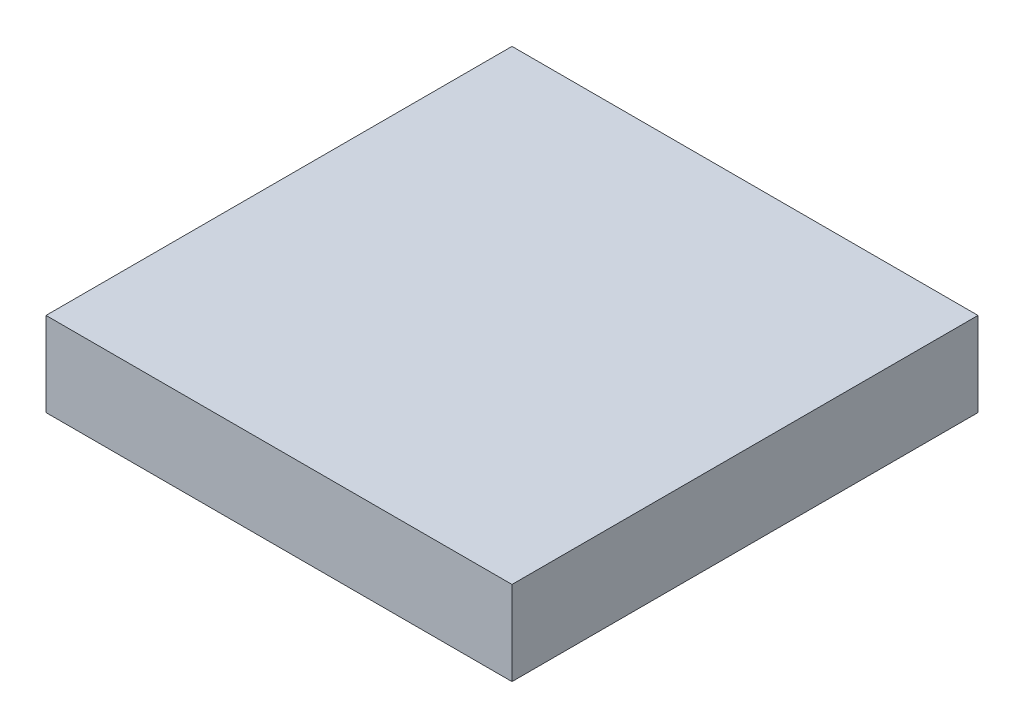
ISO-10303-21;
HEADER;
FILE_DESCRIPTION(('STEP AP214'),'2;1');
FILE_NAME('part.step','',(''),(''),'','','');
FILE_SCHEMA(('AUTOMOTIVE_DESIGN { 1 0 10303 214 1 1 1 1 }'));
ENDSEC;
DATA;
#1=APPLICATION_CONTEXT('core data for automotive mechanical design processes');
#2=APPLICATION_PROTOCOL_DEFINITION('international standard','automotive_design',2000,#1);
#3=PRODUCT_CONTEXT('',#1,'mechanical');
#4=PRODUCT('Part','Part','',(#3));
#5=PRODUCT_RELATED_PRODUCT_CATEGORY('part','',(#4));
#6=PRODUCT_DEFINITION_FORMATION('','',#4);
#7=PRODUCT_DEFINITION_CONTEXT('part definition',#1,'design');
#8=PRODUCT_DEFINITION('design','',#6,#7);
#9=PRODUCT_DEFINITION_SHAPE('','',#8);
#10=(LENGTH_UNIT() NAMED_UNIT(*) SI_UNIT(.MILLI.,.METRE.));
#11=(NAMED_UNIT(*) PLANE_ANGLE_UNIT() SI_UNIT($,.RADIAN.));
#12=(NAMED_UNIT(*) SI_UNIT($,.STERADIAN.) SOLID_ANGLE_UNIT());
#13=UNCERTAINTY_MEASURE_WITH_UNIT(LENGTH_MEASURE(1.E-05),#10,'distance_accuracy_value','');
#14=(GEOMETRIC_REPRESENTATION_CONTEXT(3) GLOBAL_UNCERTAINTY_ASSIGNED_CONTEXT((#13)) GLOBAL_UNIT_ASSIGNED_CONTEXT((#10,
#11,#12)) REPRESENTATION_CONTEXT('',''));
#15=CARTESIAN_POINT('',(0.,0.,0.));
#16=DIRECTION('',(0.,0.,1.));
#17=DIRECTION('',(1.,0.,0.));
#18=AXIS2_PLACEMENT_3D('',#15,#16,#17);
#19=CARTESIAN_POINT('',(-19.9596626410732,3.1481690140845,32.));
#20=DIRECTION('',(-0.42156835373353,0.906796627216049,0.));
#21=DIRECTION('',(-0.906796627216048,-0.42156835373353,0.));
#22=AXIS2_PLACEMENT_3D('',#19,#20,#21);
#23=PLANE('',#22);
#24=CARTESIAN_POINT('',(-20.2959038003605,2.99185101760784,16.));
#25=DIRECTION('',(0.42156835373353,-0.906796627216048,0.));
#26=DIRECTION('',(0.906796627216048,0.42156835373353,0.));
#27=AXIS2_PLACEMENT_3D('',#24,#25,#26);
#28=CIRCLE('',#27,11.6034843030688);
#29=CARTESIAN_POINT('',(-27.3625184552216,-0.293407238882376,7.40285626489718));
#30=VERTEX_POINT('',#29);
#31=CARTESIAN_POINT('',(-20.2959038003605,2.99185101760784,4.39651569693117));
#32=VERTEX_POINT('',#31);
#33=EDGE_CURVE('E268',#30,#32,#28,.T.);
#34=ORIENTED_EDGE('',*,*,#33,.F.);
#35=DIRECTION('',(-0.671741727957964,-0.312291693517609,0.671741727957964));
#36=VECTOR('',#35,1.);
#37=CARTESIAN_POINT('',(-34.3992450116317,-3.56477056448951,14.4395823705585));
#38=LINE('',#37,#36);
#39=CARTESIAN_POINT('',(-19.9596626410732,3.1481690140845,0.));
#40=VERTEX_POINT('',#39);
#41=EDGE_CURVE('E192',#40,#30,#38,.T.);
#42=ORIENTED_EDGE('',*,*,#41,.F.);
#43=DIRECTION('',(0.,0.,-1.));
#44=VECTOR('',#43,1.);
#45=CARTESIAN_POINT('',(-19.9596626410732,3.1481690140845,32.));
#46=LINE('',#45,#44);
#47=CARTESIAN_POINT('',(-19.9596626410732,3.1481690140845,32.));
#48=VERTEX_POINT('',#47);
#49=EDGE_CURVE('E353',#48,#40,#46,.T.);
#50=ORIENTED_EDGE('',*,*,#49,.F.);
#51=DIRECTION('',(0.671741727957964,0.312291693517609,0.671741727957964));
#52=VECTOR('',#51,1.);
#53=CARTESIAN_POINT('',(-19.9596626410732,3.1481690140845,32.));
#54=LINE('',#53,#52);
#55=CARTESIAN_POINT('',(-27.3623867182494,-0.293345994567157,24.5972757705994));
#56=VERTEX_POINT('',#55);
#57=EDGE_CURVE('E213',#56,#48,#54,.T.);
#58=ORIENTED_EDGE('',*,*,#57,.F.);
#59=CARTESIAN_POINT('',(-20.2959038003605,2.99185101760784,27.6034843030688));
#60=VERTEX_POINT('',#59);
#61=EDGE_CURVE('E158',#60,#56,#28,.T.);
#62=ORIENTED_EDGE('',*,*,#61,.F.);
#63=DIRECTION('',(0.,0.,1.));
#64=VECTOR('',#63,1.);
#65=CARTESIAN_POINT('',(-20.2959038003605,2.99185101760784,0.));
#66=LINE('',#65,#64);
#67=EDGE_CURVE('E162',#32,#60,#66,.T.);
#68=ORIENTED_EDGE('',*,*,#67,.F.);
#69=EDGE_LOOP('',(#34,#42,#50,#58,#62,#68));
#70=FACE_BOUND('',#69,.T.);
#71=ADVANCED_FACE('F35',(#70),#23,.F.);
#72=EDGE_CURVE('E274',#56,#30,#28,.T.);
#73=ORIENTED_EDGE('',*,*,#72,.F.);
#74=CARTESIAN_POINT('',(-35.9596626410732,-4.29020631428936,16.));
#75=VERTEX_POINT('',#74);
#76=EDGE_CURVE('E215',#75,#56,#54,.T.);
#77=ORIENTED_EDGE('',*,*,#76,.F.);
#78=EDGE_CURVE('E210',#30,#75,#38,.T.);
#79=ORIENTED_EDGE('',*,*,#78,.F.);
#80=EDGE_LOOP('',(#73,#77,#79));
#81=FACE_BOUND('',#80,.T.);
#82=ADVANCED_FACE('F259',(#81),#23,.F.);
#83=CARTESIAN_POINT('',(-52.9596626410732,2.58867680453672,1.20347185474998));
#84=DIRECTION('',(0.,-0.906796627216048,-0.42156835373353));
#85=DIRECTION('',(0.,0.42156835373353,-0.906796627216049));
#86=AXIS2_PLACEMENT_3D('',#83,#84,#85);
#87=PLANE('',#86);
#88=DIRECTION('',(1.,0.,0.));
#89=VECTOR('',#88,1.);
#90=CARTESIAN_POINT('',(0.,2.99431103187024,0.330949650528911));
#91=LINE('',#90,#89);
#92=CARTESIAN_POINT('',(-47.5670668167245,2.99431103187024,0.330949650528911));
#93=VERTEX_POINT('',#92);
#94=CARTESIAN_POINT('',(-24.3522584654219,2.99431103187024,0.330949650528911));
#95=VERTEX_POINT('',#94);
#96=EDGE_CURVE('E53',#93,#95,#91,.T.);
#97=ORIENTED_EDGE('',*,*,#96,.F.);
#98=CARTESIAN_POINT('',(-35.9596626410732,2.99431103187024,0.330949650528909));
#99=DIRECTION('',(0.,-0.906796627216048,-0.421568353733531));
#100=DIRECTION('',(0.,0.421568353733531,-0.906796627216048));
#101=AXIS2_PLACEMENT_3D('',#98,#99,#100);
#102=CIRCLE('',#101,11.6074041756513);
#103=CARTESIAN_POINT('',(-44.5586613166072,-0.29254507336374,7.40100128978124));
#104=VERTEX_POINT('',#103);
#105=EDGE_CURVE('E165',#104,#93,#102,.T.);
#106=ORIENTED_EDGE('',*,*,#105,.F.);
#107=DIRECTION('',(-0.671741727957964,0.312291693517609,-0.671741727957964));
#108=VECTOR('',#107,1.);
#109=CARTESIAN_POINT('',(-28.739871455794,-7.64667610357636,23.2197911852792));
#110=LINE('',#109,#108);
#111=CARTESIAN_POINT('',(-51.9596626410732,3.1481690140845,0.));
#112=VERTEX_POINT('',#111);
#113=EDGE_CURVE('E188',#104,#112,#110,.T.);
#114=ORIENTED_EDGE('',*,*,#113,.T.);
#115=DIRECTION('',(-1.,0.,0.));
#116=VECTOR('',#115,1.);
#117=CARTESIAN_POINT('',(0.,3.1481690140845,0.));
#118=LINE('',#117,#116);
#119=EDGE_CURVE('E282',#40,#112,#118,.T.);
#120=ORIENTED_EDGE('',*,*,#119,.F.);
#121=ORIENTED_EDGE('',*,*,#41,.T.);
#122=EDGE_CURVE('E39',#95,#30,#102,.T.);
#123=ORIENTED_EDGE('',*,*,#122,.F.);
#124=EDGE_LOOP('',(#97,#106,#114,#120,#121,#123));
#125=FACE_BOUND('',#124,.T.);
#126=ADVANCED_FACE('F264',(#125),#87,.T.);
#127=EDGE_CURVE('E191',#75,#104,#110,.T.);
#128=ORIENTED_EDGE('',*,*,#127,.T.);
#129=EDGE_CURVE('E184',#30,#104,#102,.T.);
#130=ORIENTED_EDGE('',*,*,#129,.F.);
#131=ORIENTED_EDGE('',*,*,#78,.T.);
#132=EDGE_LOOP('',(#128,#130,#131));
#133=FACE_BOUND('',#132,.T.);
#134=ADVANCED_FACE('F242',(#133),#87,.T.);
#135=CARTESIAN_POINT('',(-35.9596626410732,-4.29020631428936,32.));
#136=DIRECTION('',(0.42156835373353,0.906796627216049,0.));
#137=DIRECTION('',(-0.906796627216049,0.42156835373353,0.));
#138=AXIS2_PLACEMENT_3D('',#135,#136,#137);
#139=PLANE('',#138);
#140=CARTESIAN_POINT('',(-51.6301810914794,2.99499354973117,16.));
#141=DIRECTION('',(-0.42156835373353,-0.906796627216049,0.));
#142=DIRECTION('',(0.906796627216049,-0.42156835373353,0.));
#143=AXIS2_PLACEMENT_3D('',#140,#141,#142);
#144=CIRCLE('',#143,11.6084917234314);
#145=CARTESIAN_POINT('',(-44.559064155417,-0.292357810347127,24.5994015143438));
#146=VERTEX_POINT('',#145);
#147=EDGE_CURVE('E185',#104,#146,#144,.T.);
#148=ORIENTED_EDGE('',*,*,#147,.F.);
#149=ORIENTED_EDGE('',*,*,#127,.F.);
#150=CARTESIAN_POINT('',(-44.559064155417,-0.292357810347124,24.5994015143438));
#151=DIRECTION('',(0.671741727957965,-0.312291693517609,-0.671741727957964));
#152=VECTOR('',#151,1.);
#153=LINE('',#150,#152);
#154=EDGE_CURVE('E225',#146,#75,#153,.T.);
#155=ORIENTED_EDGE('',*,*,#154,.F.);
#156=EDGE_LOOP('',(#148,#149,#155));
#157=FACE_BOUND('',#156,.T.);
#158=ADVANCED_FACE('F232',(#157),#139,.F.);
#159=CARTESIAN_POINT('',(-51.6301810914794,2.99499354973117,4.39150827656862));
#160=VERTEX_POINT('',#159);
#161=EDGE_CURVE('E193',#160,#104,#144,.T.);
#162=ORIENTED_EDGE('',*,*,#161,.F.);
#163=DIRECTION('',(0.,0.,-1.));
#164=VECTOR('',#163,1.);
#165=CARTESIAN_POINT('',(-51.6301810914794,2.99499354973117,16.));
#166=LINE('',#165,#164);
#167=CARTESIAN_POINT('',(-51.6301810914794,2.99499354973118,27.6084917234314));
#168=VERTEX_POINT('',#167);
#169=EDGE_CURVE('E61',#168,#160,#166,.T.);
#170=ORIENTED_EDGE('',*,*,#169,.F.);
#171=EDGE_CURVE('E310',#146,#168,#144,.T.);
#172=ORIENTED_EDGE('',*,*,#171,.F.);
#173=DIRECTION('',(0.671741727957964,-0.312291693517609,-0.671741727957964));
#174=VECTOR('',#173,1.);
#175=CARTESIAN_POINT('',(-43.1794538263524,-0.933736525002352,23.2197911852792));
#176=LINE('',#175,#174);
#177=CARTESIAN_POINT('',(-51.9596626410732,3.1481690140845,32.));
#178=VERTEX_POINT('',#177);
#179=EDGE_CURVE('E212',#178,#146,#176,.T.);
#180=ORIENTED_EDGE('',*,*,#179,.F.);
#181=DIRECTION('',(0.,0.,-1.));
#182=VECTOR('',#181,1.);
#183=CARTESIAN_POINT('',(-51.9596626410732,3.1481690140845,32.));
#184=LINE('',#183,#182);
#185=EDGE_CURVE('E291',#178,#112,#184,.T.);
#186=ORIENTED_EDGE('',*,*,#185,.T.);
#187=ORIENTED_EDGE('',*,*,#113,.F.);
#188=EDGE_LOOP('',(#162,#170,#172,#180,#186,#187));
#189=FACE_BOUND('',#188,.T.);
#190=ADVANCED_FACE('F241',(#189),#139,.F.);
#191=CARTESIAN_POINT('',(-52.9596626410732,-9.64417955727407,4.48356420507719));
#192=DIRECTION('',(0.,-0.906796627216048,0.42156835373353));
#193=DIRECTION('',(0.,-0.42156835373353,-0.906796627216049));
#194=AXIS2_PLACEMENT_3D('',#191,#192,#193);
#195=PLANE('',#194);
#196=CARTESIAN_POINT('',(-35.9596626410732,2.99510070606784,31.6707489444739));
#197=DIRECTION('',(0.,-0.906796627216048,0.42156835373353));
#198=DIRECTION('',(0.,-0.42156835373353,-0.906796627216048));
#199=AXIS2_PLACEMENT_3D('',#196,#197,#198);
#200=CIRCLE('',#199,11.6086624700781);
#201=CARTESIAN_POINT('',(-47.5683251111513,2.99510070606784,31.6707489444739));
#202=VERTEX_POINT('',#201);
#203=EDGE_CURVE('E295',#202,#146,#200,.T.);
#204=ORIENTED_EDGE('',*,*,#203,.F.);
#205=DIRECTION('',(-1.,0.,0.));
#206=VECTOR('',#205,1.);
#207=CARTESIAN_POINT('',(-47.5683251111513,2.99510070606784,31.6707489444739));
#208=LINE('',#207,#206);
#209=CARTESIAN_POINT('',(-24.3510001709951,2.99510070606784,31.6707489444739));
#210=VERTEX_POINT('',#209);
#211=EDGE_CURVE('E298',#210,#202,#208,.T.);
#212=ORIENTED_EDGE('',*,*,#211,.F.);
#213=EDGE_CURVE('E45',#56,#210,#200,.T.);
#214=ORIENTED_EDGE('',*,*,#213,.F.);
#215=ORIENTED_EDGE('',*,*,#57,.T.);
#216=DIRECTION('',(1.,0.,0.));
#217=VECTOR('',#216,1.);
#218=CARTESIAN_POINT('',(-52.9596626410732,3.1481690140845,32.));
#219=LINE('',#218,#217);
#220=EDGE_CURVE('E216',#178,#48,#219,.T.);
#221=ORIENTED_EDGE('',*,*,#220,.F.);
#222=ORIENTED_EDGE('',*,*,#179,.T.);
#223=EDGE_LOOP('',(#204,#212,#214,#215,#221,#222));
#224=FACE_BOUND('',#223,.T.);
#225=ADVANCED_FACE('F328',(#224),#195,.T.);
#226=CARTESIAN_POINT('',(0.,0.,32.));
#227=DIRECTION('',(0.,0.,-1.));
#228=DIRECTION('',(-1.,0.,0.));
#229=AXIS2_PLACEMENT_3D('',#226,#227,#228);
#230=PLANE('',#229);
#231=ORIENTED_EDGE('',*,*,#220,.T.);
#232=DIRECTION('',(0.,1.,0.));
#233=VECTOR('',#232,1.);
#234=CARTESIAN_POINT('',(-19.9596626410732,8.92782935791853,32.));
#235=LINE('',#234,#233);
#236=CARTESIAN_POINT('',(-19.9596626410732,8.92782935791853,32.));
#237=VERTEX_POINT('',#236);
#238=EDGE_CURVE('E354',#48,#237,#235,.T.);
#239=ORIENTED_EDGE('',*,*,#238,.T.);
#240=DIRECTION('',(-1.,0.,0.));
#241=VECTOR('',#240,1.);
#242=CARTESIAN_POINT('',(-51.9596626410732,8.92782935791853,32.));
#243=LINE('',#242,#241);
#244=CARTESIAN_POINT('',(-51.9596626410732,8.92782935791853,32.));
#245=VERTEX_POINT('',#244);
#246=EDGE_CURVE('E199',#237,#245,#243,.T.);
#247=ORIENTED_EDGE('',*,*,#246,.T.);
#248=DIRECTION('',(0.,-1.,0.));
#249=VECTOR('',#248,1.);
#250=CARTESIAN_POINT('',(-51.9596626410732,8.92782935791853,32.));
#251=LINE('',#250,#249);
#252=EDGE_CURVE('E347',#245,#178,#251,.T.);
#253=ORIENTED_EDGE('',*,*,#252,.T.);
#254=EDGE_LOOP('',(#231,#239,#247,#253));
#255=FACE_BOUND('',#254,.T.);
#256=ADVANCED_FACE('F332',(#255),#230,.F.);
#257=CARTESIAN_POINT('',(0.,0.,0.));
#258=DIRECTION('',(0.,0.,-1.));
#259=DIRECTION('',(-1.,0.,0.));
#260=AXIS2_PLACEMENT_3D('',#257,#258,#259);
#261=PLANE('',#260);
#262=DIRECTION('',(0.,1.,0.));
#263=VECTOR('',#262,1.);
#264=CARTESIAN_POINT('',(-19.9596626410732,8.92782935791853,0.));
#265=LINE('',#264,#263);
#266=CARTESIAN_POINT('',(-19.9596626410732,8.92782935791853,0.));
#267=VERTEX_POINT('',#266);
#268=EDGE_CURVE('E340',#40,#267,#265,.T.);
#269=ORIENTED_EDGE('',*,*,#268,.F.);
#270=ORIENTED_EDGE('',*,*,#119,.T.);
#271=DIRECTION('',(0.,-1.,0.));
#272=VECTOR('',#271,1.);
#273=CARTESIAN_POINT('',(-51.9596626410732,8.92782935791853,0.));
#274=LINE('',#273,#272);
#275=CARTESIAN_POINT('',(-51.9596626410732,8.92782935791853,0.));
#276=VERTEX_POINT('',#275);
#277=EDGE_CURVE('E344',#276,#112,#274,.T.);
#278=ORIENTED_EDGE('',*,*,#277,.F.);
#279=DIRECTION('',(-1.,0.,0.));
#280=VECTOR('',#279,1.);
#281=CARTESIAN_POINT('',(-51.9596626410732,8.92782935791853,0.));
#282=LINE('',#281,#280);
#283=EDGE_CURVE('E204',#267,#276,#282,.T.);
#284=ORIENTED_EDGE('',*,*,#283,.F.);
#285=EDGE_LOOP('',(#269,#270,#278,#284));
#286=FACE_BOUND('',#285,.T.);
#287=ADVANCED_FACE('F255',(#286),#261,.T.);
#288=CARTESIAN_POINT('',(-51.9596626410732,8.92782935791853,32.));
#289=DIRECTION('',(0.,-1.,0.));
#290=DIRECTION('',(0.,0.,-1.));
#291=AXIS2_PLACEMENT_3D('',#288,#289,#290);
#292=PLANE('',#291);
#293=ORIENTED_EDGE('',*,*,#283,.T.);
#294=DIRECTION('',(0.,0.,-1.));
#295=VECTOR('',#294,1.);
#296=CARTESIAN_POINT('',(-51.9596626410732,8.92782935791853,32.));
#297=LINE('',#296,#295);
#298=EDGE_CURVE('E287',#245,#276,#297,.T.);
#299=ORIENTED_EDGE('',*,*,#298,.F.);
#300=ORIENTED_EDGE('',*,*,#246,.F.);
#301=DIRECTION('',(0.,0.,-1.));
#302=VECTOR('',#301,1.);
#303=CARTESIAN_POINT('',(-19.9596626410732,8.92782935791853,32.));
#304=LINE('',#303,#302);
#305=EDGE_CURVE('E351',#237,#267,#304,.T.);
#306=ORIENTED_EDGE('',*,*,#305,.T.);
#307=EDGE_LOOP('',(#293,#299,#300,#306));
#308=FACE_BOUND('',#307,.T.);
#309=ADVANCED_FACE('F37',(#308),#292,.F.);
#310=CARTESIAN_POINT('',(-51.9596626410732,8.92782935791853,32.));
#311=DIRECTION('',(1.,0.,0.));
#312=DIRECTION('',(0.,1.,0.));
#313=AXIS2_PLACEMENT_3D('',#310,#311,#312);
#314=PLANE('',#313);
#315=ORIENTED_EDGE('',*,*,#277,.T.);
#316=ORIENTED_EDGE('',*,*,#185,.F.);
#317=ORIENTED_EDGE('',*,*,#252,.F.);
#318=ORIENTED_EDGE('',*,*,#298,.T.);
#319=EDGE_LOOP('',(#315,#316,#317,#318));
#320=FACE_BOUND('',#319,.T.);
#321=ADVANCED_FACE('F245',(#320),#314,.F.);
#322=CARTESIAN_POINT('',(-19.9596626410732,8.92782935791853,32.));
#323=DIRECTION('',(-1.,0.,0.));
#324=DIRECTION('',(0.,0.,1.));
#325=AXIS2_PLACEMENT_3D('',#322,#323,#324);
#326=PLANE('',#325);
#327=ORIENTED_EDGE('',*,*,#268,.T.);
#328=ORIENTED_EDGE('',*,*,#305,.F.);
#329=ORIENTED_EDGE('',*,*,#238,.F.);
#330=ORIENTED_EDGE('',*,*,#49,.T.);
#331=EDGE_LOOP('',(#327,#328,#329,#330));
#332=FACE_BOUND('',#331,.T.);
#333=ADVANCED_FACE('F247',(#332),#326,.F.);
#334=EDGE_CURVE('E11',#146,#56,#200,.T.);
#335=ORIENTED_EDGE('',*,*,#334,.F.);
#336=ORIENTED_EDGE('',*,*,#154,.T.);
#337=ORIENTED_EDGE('',*,*,#76,.T.);
#338=EDGE_LOOP('',(#335,#336,#337));
#339=FACE_BOUND('',#338,.T.);
#340=ADVANCED_FACE('F253',(#339),#195,.T.);
#341=CARTESIAN_POINT('',(-35.9596626410732,2.98603273979568,31.6749646280112));
#342=DIRECTION('',(0.,0.906796627216048,-0.42156835373353));
#343=DIRECTION('',(0.,0.42156835373353,0.906796627216048));
#344=AXIS2_PLACEMENT_3D('',#341,#342,#343);
#345=CYLINDRICAL_SURFACE('',#344,11.6086624700781);
#346=ORIENTED_EDGE('',*,*,#203,.T.);
#347=ORIENTED_EDGE('',*,*,#334,.T.);
#348=ORIENTED_EDGE('',*,*,#213,.T.);
#349=DIRECTION('',(0.,0.906796627216048,-0.42156835373353));
#350=VECTOR('',#349,1.);
#351=CARTESIAN_POINT('',(-24.3510001709951,2.98603273979568,31.6749646280112));
#352=LINE('',#351,#350);
#353=CARTESIAN_POINT('',(-24.3510001709951,2.98603273979568,31.6749646280112));
#354=VERTEX_POINT('',#353);
#355=EDGE_CURVE('E570',#354,#210,#352,.T.);
#356=ORIENTED_EDGE('',*,*,#355,.F.);
#357=CARTESIAN_POINT('',(-35.9596626410732,2.98603273979568,31.6749646280112));
#358=DIRECTION('',(0.,-0.906796627216048,0.42156835373353));
#359=DIRECTION('',(0.,-0.42156835373353,-0.906796627216048));
#360=AXIS2_PLACEMENT_3D('',#357,#358,#359);
#361=CIRCLE('',#360,11.6086624700781);
#362=CARTESIAN_POINT('',(-47.5683251111513,2.98603273979568,31.6749646280112));
#363=VERTEX_POINT('',#362);
#364=EDGE_CURVE('E384',#363,#354,#361,.T.);
#365=ORIENTED_EDGE('',*,*,#364,.F.);
#366=DIRECTION('',(0.,0.906796627216048,-0.42156835373353));
#367=VECTOR('',#366,1.);
#368=CARTESIAN_POINT('',(-47.5683251111513,2.98603273979568,31.6749646280112));
#369=LINE('',#368,#367);
#370=EDGE_CURVE('E388',#363,#202,#369,.T.);
#371=ORIENTED_EDGE('',*,*,#370,.T.);
#372=EDGE_LOOP('',(#346,#347,#348,#356,#365,#371));
#373=FACE_BOUND('',#372,.T.);
#374=ADVANCED_FACE('F327',(#373),#345,.T.);
#375=CARTESIAN_POINT('',(-47.5683251111513,2.98603273979568,31.6749646280112));
#376=DIRECTION('',(0.,-0.42156835373353,-0.906796627216048));
#377=DIRECTION('',(0.,0.906796627216048,-0.42156835373353));
#378=AXIS2_PLACEMENT_3D('',#375,#376,#377);
#379=PLANE('',#378);
#380=ORIENTED_EDGE('',*,*,#211,.T.);
#381=ORIENTED_EDGE('',*,*,#370,.F.);
#382=DIRECTION('',(-1.,0.,0.));
#383=VECTOR('',#382,1.);
#384=CARTESIAN_POINT('',(-36.0718156049131,2.98603273979568,31.6749646280112));
#385=LINE('',#384,#383);
#386=EDGE_CURVE('E304',#354,#363,#385,.T.);
#387=ORIENTED_EDGE('',*,*,#386,.F.);
#388=ORIENTED_EDGE('',*,*,#355,.T.);
#389=EDGE_LOOP('',(#380,#381,#387,#388));
#390=FACE_BOUND('',#389,.T.);
#391=ADVANCED_FACE('F435',(#390),#379,.F.);
#392=CARTESIAN_POINT('',(-35.9596626410732,2.98603273979568,31.6749646280112));
#393=DIRECTION('',(0.,-0.906796627216048,0.42156835373353));
#394=DIRECTION('',(0.,-0.42156835373353,-0.906796627216048));
#395=AXIS2_PLACEMENT_3D('',#392,#393,#394);
#396=PLANE('',#395);
#397=ORIENTED_EDGE('',*,*,#364,.T.);
#398=ORIENTED_EDGE('',*,*,#386,.T.);
#399=EDGE_LOOP('',(#397,#398));
#400=FACE_BOUND('',#399,.T.);
#401=ADVANCED_FACE('F432',(#400),#396,.T.);
#402=CARTESIAN_POINT('',(-51.6343967750167,2.98592558345901,16.));
#403=DIRECTION('',(0.42156835373353,0.906796627216048,0.));
#404=DIRECTION('',(-0.906796627216048,0.42156835373353,0.));
#405=AXIS2_PLACEMENT_3D('',#402,#403,#404);
#406=CYLINDRICAL_SURFACE('',#405,11.6084917234314);
#407=ORIENTED_EDGE('',*,*,#161,.T.);
#408=ORIENTED_EDGE('',*,*,#147,.T.);
#409=ORIENTED_EDGE('',*,*,#171,.T.);
#410=DIRECTION('',(0.42156835373353,0.906796627216048,0.));
#411=VECTOR('',#410,1.);
#412=CARTESIAN_POINT('',(-51.6343967750167,2.98592558345901,27.6084917234314));
#413=LINE('',#412,#411);
#414=CARTESIAN_POINT('',(-51.6343967750167,2.98592558345901,27.6084917234314));
#415=VERTEX_POINT('',#414);
#416=EDGE_CURVE('E392',#415,#168,#413,.T.);
#417=ORIENTED_EDGE('',*,*,#416,.F.);
#418=CARTESIAN_POINT('',(-51.6343967750167,2.98592558345901,16.));
#419=DIRECTION('',(-0.42156835373353,-0.906796627216049,0.));
#420=DIRECTION('',(0.906796627216049,-0.42156835373353,0.));
#421=AXIS2_PLACEMENT_3D('',#418,#419,#420);
#422=CIRCLE('',#421,11.6084917234314);
#423=CARTESIAN_POINT('',(-51.6343967750167,2.98592558345901,4.39150827656862));
#424=VERTEX_POINT('',#423);
#425=EDGE_CURVE('E395',#424,#415,#422,.T.);
#426=ORIENTED_EDGE('',*,*,#425,.F.);
#427=DIRECTION('',(0.42156835373353,0.906796627216048,0.));
#428=VECTOR('',#427,1.);
#429=CARTESIAN_POINT('',(-51.6343967750167,2.98592558345901,4.39150827656862));
#430=LINE('',#429,#428);
#431=EDGE_CURVE('E299',#424,#160,#430,.T.);
#432=ORIENTED_EDGE('',*,*,#431,.T.);
#433=EDGE_LOOP('',(#407,#408,#409,#417,#426,#432));
#434=FACE_BOUND('',#433,.T.);
#435=ADVANCED_FACE('F428',(#434),#406,.T.);
#436=CARTESIAN_POINT('',(-51.6343967750167,2.98592558345901,16.));
#437=DIRECTION('',(0.906796627216048,-0.42156835373353,0.));
#438=DIRECTION('',(0.42156835373353,0.906796627216049,0.));
#439=AXIS2_PLACEMENT_3D('',#436,#437,#438);
#440=PLANE('',#439);
#441=ORIENTED_EDGE('',*,*,#169,.T.);
#442=ORIENTED_EDGE('',*,*,#431,.F.);
#443=DIRECTION('',(0.,0.,-1.));
#444=VECTOR('',#443,1.);
#445=CARTESIAN_POINT('',(-51.6343967750167,2.98592558345901,16.));
#446=LINE('',#445,#444);
#447=EDGE_CURVE('E396',#415,#424,#446,.T.);
#448=ORIENTED_EDGE('',*,*,#447,.F.);
#449=ORIENTED_EDGE('',*,*,#416,.T.);
#450=EDGE_LOOP('',(#441,#442,#448,#449));
#451=FACE_BOUND('',#450,.T.);
#452=ADVANCED_FACE('F424',(#451),#440,.F.);
#453=CARTESIAN_POINT('',(-51.6343967750167,2.98592558345901,16.));
#454=DIRECTION('',(-0.42156835373353,-0.906796627216049,0.));
#455=DIRECTION('',(0.906796627216049,-0.42156835373353,0.));
#456=AXIS2_PLACEMENT_3D('',#453,#454,#455);
#457=PLANE('',#456);
#458=ORIENTED_EDGE('',*,*,#447,.T.);
#459=ORIENTED_EDGE('',*,*,#425,.T.);
#460=EDGE_LOOP('',(#458,#459));
#461=FACE_BOUND('',#460,.T.);
#462=ADVANCED_FACE('F421',(#461),#457,.T.);
#463=CARTESIAN_POINT('',(0.,2.98524306559808,0.326733966991576));
#464=DIRECTION('',(0.,-0.42156835373353,0.906796627216048));
#465=DIRECTION('',(0.,-0.906796627216048,-0.42156835373353));
#466=AXIS2_PLACEMENT_3D('',#463,#464,#465);
#467=PLANE('',#466);
#468=ORIENTED_EDGE('',*,*,#96,.T.);
#469=DIRECTION('',(0.,0.906796627216048,0.42156835373353));
#470=VECTOR('',#469,1.);
#471=CARTESIAN_POINT('',(-24.3522584654219,2.98524306559808,0.326733966991576));
#472=LINE('',#471,#470);
#473=CARTESIAN_POINT('',(-24.3522584654219,2.98524306559808,0.326733966991576));
#474=VERTEX_POINT('',#473);
#475=EDGE_CURVE('E279',#474,#95,#472,.T.);
#476=ORIENTED_EDGE('',*,*,#475,.F.);
#477=DIRECTION('',(1.,0.,0.));
#478=VECTOR('',#477,1.);
#479=CARTESIAN_POINT('',(0.,2.98524306559808,0.326733966991576));
#480=LINE('',#479,#478);
#481=CARTESIAN_POINT('',(-47.5670668167245,2.98524306559808,0.326733966991576));
#482=VERTEX_POINT('',#481);
#483=EDGE_CURVE('E170',#482,#474,#480,.T.);
#484=ORIENTED_EDGE('',*,*,#483,.F.);
#485=DIRECTION('',(0.,0.906796627216048,0.42156835373353));
#486=VECTOR('',#485,1.);
#487=CARTESIAN_POINT('',(-47.5670668167245,2.98524306559808,0.326733966991576));
#488=LINE('',#487,#486);
#489=EDGE_CURVE('E174',#482,#93,#488,.T.);
#490=ORIENTED_EDGE('',*,*,#489,.T.);
#491=EDGE_LOOP('',(#468,#476,#484,#490));
#492=FACE_BOUND('',#491,.T.);
#493=ADVANCED_FACE('F406',(#492),#467,.F.);
#494=CARTESIAN_POINT('',(-35.9596626410732,2.98524306559808,0.326733966991574));
#495=DIRECTION('',(0.,0.906796627216048,0.42156835373353));
#496=DIRECTION('',(0.,-0.42156835373353,0.906796627216048));
#497=AXIS2_PLACEMENT_3D('',#494,#495,#496);
#498=CYLINDRICAL_SURFACE('',#497,11.6074041756513);
#499=ORIENTED_EDGE('',*,*,#122,.T.);
#500=ORIENTED_EDGE('',*,*,#129,.T.);
#501=ORIENTED_EDGE('',*,*,#105,.T.);
#502=ORIENTED_EDGE('',*,*,#489,.F.);
#503=CARTESIAN_POINT('',(-35.9596626410732,2.98524306559808,0.326733966991574));
#504=DIRECTION('',(0.,-0.906796627216048,-0.421568353733531));
#505=DIRECTION('',(0.,0.421568353733531,-0.906796627216048));
#506=AXIS2_PLACEMENT_3D('',#503,#504,#505);
#507=CIRCLE('',#506,11.6074041756513);
#508=EDGE_CURVE('E173',#474,#482,#507,.T.);
#509=ORIENTED_EDGE('',*,*,#508,.F.);
#510=ORIENTED_EDGE('',*,*,#475,.T.);
#511=EDGE_LOOP('',(#499,#500,#501,#502,#509,#510));
#512=FACE_BOUND('',#511,.T.);
#513=ADVANCED_FACE('F277',(#512),#498,.T.);
#514=CARTESIAN_POINT('',(0.,2.57960883826456,1.19925617121264));
#515=DIRECTION('',(0.,-0.906796627216048,-0.421568353733531));
#516=DIRECTION('',(0.,0.421568353733531,-0.906796627216048));
#517=AXIS2_PLACEMENT_3D('',#514,#515,#516);
#518=PLANE('',#517);
#519=ORIENTED_EDGE('',*,*,#483,.T.);
#520=ORIENTED_EDGE('',*,*,#508,.T.);
#521=EDGE_LOOP('',(#519,#520));
#522=FACE_BOUND('',#521,.T.);
#523=ADVANCED_FACE('F408',(#522),#518,.T.);
#524=CARTESIAN_POINT('',(-20.2916881168232,2.98278305133568,0.));
#525=DIRECTION('',(-0.906796627216048,-0.42156835373353,0.));
#526=DIRECTION('',(0.42156835373353,-0.906796627216048,0.));
#527=AXIS2_PLACEMENT_3D('',#524,#525,#526);
#528=PLANE('',#527);
#529=ORIENTED_EDGE('',*,*,#67,.T.);
#530=DIRECTION('',(-0.42156835373353,0.906796627216048,0.));
#531=VECTOR('',#530,1.);
#532=CARTESIAN_POINT('',(-20.2916881168232,2.98278305133568,27.6034843030688));
#533=LINE('',#532,#531);
#534=CARTESIAN_POINT('',(-20.2916881168232,2.98278305133568,27.6034843030688));
#535=VERTEX_POINT('',#534);
#536=EDGE_CURVE('E148',#535,#60,#533,.T.);
#537=ORIENTED_EDGE('',*,*,#536,.F.);
#538=DIRECTION('',(0.,0.,1.));
#539=VECTOR('',#538,1.);
#540=CARTESIAN_POINT('',(-20.2916881168232,2.98278305133568,0.));
#541=LINE('',#540,#539);
#542=CARTESIAN_POINT('',(-20.2916881168232,2.98278305133568,4.39651569693117));
#543=VERTEX_POINT('',#542);
#544=EDGE_CURVE('E154',#543,#535,#541,.T.);
#545=ORIENTED_EDGE('',*,*,#544,.F.);
#546=DIRECTION('',(-0.42156835373353,0.906796627216048,0.));
#547=VECTOR('',#546,1.);
#548=CARTESIAN_POINT('',(-20.2916881168232,2.98278305133568,4.39651569693117));
#549=LINE('',#548,#547);
#550=EDGE_CURVE('E151',#543,#32,#549,.T.);
#551=ORIENTED_EDGE('',*,*,#550,.T.);
#552=EDGE_LOOP('',(#529,#537,#545,#551));
#553=FACE_BOUND('',#552,.T.);
#554=ADVANCED_FACE('F160',(#553),#528,.F.);
#555=CARTESIAN_POINT('',(-20.2916881168232,2.98278305133568,16.));
#556=DIRECTION('',(-0.42156835373353,0.906796627216048,0.));
#557=DIRECTION('',(-0.906796627216048,-0.42156835373353,0.));
#558=AXIS2_PLACEMENT_3D('',#555,#556,#557);
#559=CYLINDRICAL_SURFACE('',#558,11.6034843030688);
#560=ORIENTED_EDGE('',*,*,#61,.T.);
#561=ORIENTED_EDGE('',*,*,#72,.T.);
#562=ORIENTED_EDGE('',*,*,#33,.T.);
#563=ORIENTED_EDGE('',*,*,#550,.F.);
#564=CARTESIAN_POINT('',(-20.2916881168232,2.98278305133568,16.));
#565=DIRECTION('',(0.42156835373353,-0.906796627216048,0.));
#566=DIRECTION('',(0.906796627216048,0.42156835373353,0.));
#567=AXIS2_PLACEMENT_3D('',#564,#565,#566);
#568=CIRCLE('',#567,11.6034843030688);
#569=EDGE_CURVE('E144',#535,#543,#568,.T.);
#570=ORIENTED_EDGE('',*,*,#569,.F.);
#571=ORIENTED_EDGE('',*,*,#536,.T.);
#572=EDGE_LOOP('',(#560,#561,#562,#563,#570,#571));
#573=FACE_BOUND('',#572,.T.);
#574=ADVANCED_FACE('F146',(#573),#559,.T.);
#575=CARTESIAN_POINT('',(-4.74648495814291,10.2097240294661,0.));
#576=DIRECTION('',(0.42156835373353,-0.906796627216048,0.));
#577=DIRECTION('',(0.906796627216048,0.42156835373353,0.));
#578=AXIS2_PLACEMENT_3D('',#575,#576,#577);
#579=PLANE('',#578);
#580=ORIENTED_EDGE('',*,*,#544,.T.);
#581=ORIENTED_EDGE('',*,*,#569,.T.);
#582=EDGE_LOOP('',(#580,#581));
#583=FACE_BOUND('',#582,.T.);
#584=ADVANCED_FACE('F156',(#583),#579,.T.);
#585=CLOSED_SHELL('',(#71,#82,#126,#134,#158,#190,#225,#256,#287,#309,#321,#333,#340,#374,#391,
#401,#435,#452,#462,#493,#513,#523,#554,#574,#584));
#586=MANIFOLD_SOLID_BREP('B2',#585);
#587=ADVANCED_BREP_SHAPE_REPRESENTATION('',(#18,#586),#14);
#588=SHAPE_DEFINITION_REPRESENTATION(#9,#587);
ENDSEC;
END-ISO-10303-21;
